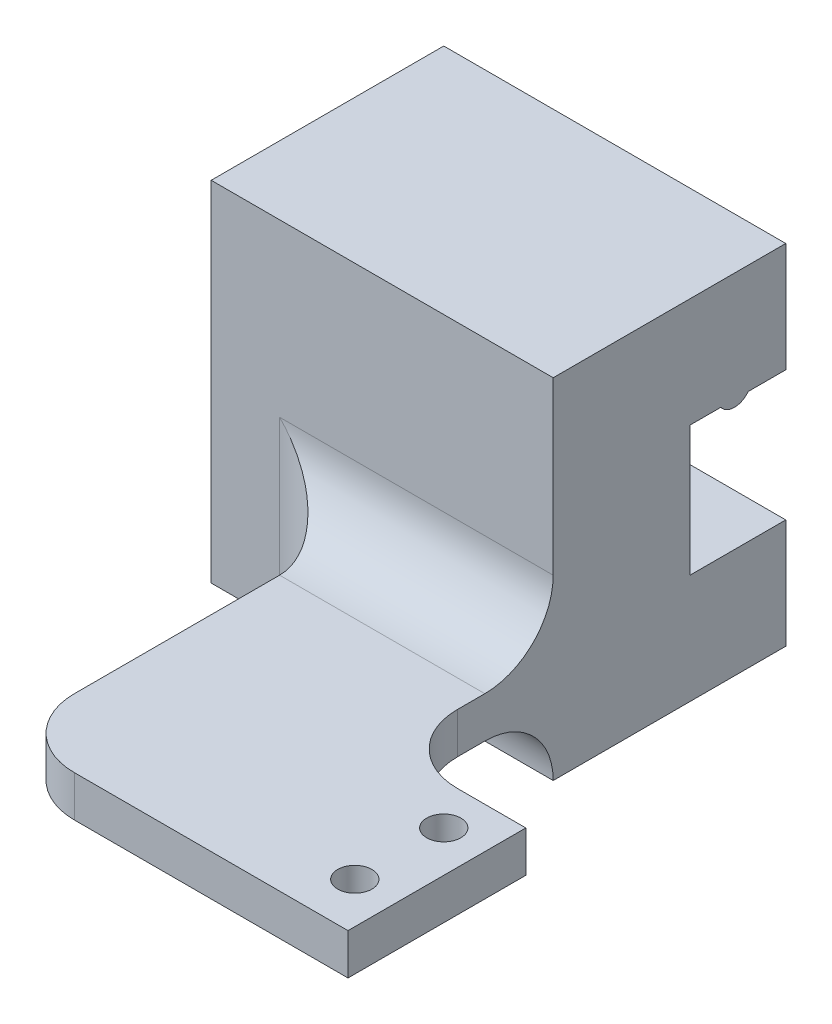
ISO-10303-21;
HEADER;
FILE_DESCRIPTION(('STEP AP214'),'2;1');
FILE_NAME('part.step','',(''),(''),'','','');
FILE_SCHEMA(('AUTOMOTIVE_DESIGN { 1 0 10303 214 1 1 1 1 }'));
ENDSEC;
DATA;
#1=APPLICATION_CONTEXT('core data for automotive mechanical design processes');
#2=APPLICATION_PROTOCOL_DEFINITION('international standard','automotive_design',2000,#1);
#3=PRODUCT_CONTEXT('',#1,'mechanical');
#4=PRODUCT('Part','Part','',(#3));
#5=PRODUCT_RELATED_PRODUCT_CATEGORY('part','',(#4));
#6=PRODUCT_DEFINITION_FORMATION('','',#4);
#7=PRODUCT_DEFINITION_CONTEXT('part definition',#1,'design');
#8=PRODUCT_DEFINITION('design','',#6,#7);
#9=PRODUCT_DEFINITION_SHAPE('','',#8);
#10=(LENGTH_UNIT() NAMED_UNIT(*) SI_UNIT(.MILLI.,.METRE.));
#11=(NAMED_UNIT(*) PLANE_ANGLE_UNIT() SI_UNIT($,.RADIAN.));
#12=(NAMED_UNIT(*) SI_UNIT($,.STERADIAN.) SOLID_ANGLE_UNIT());
#13=UNCERTAINTY_MEASURE_WITH_UNIT(LENGTH_MEASURE(1.E-05),#10,'distance_accuracy_value','');
#14=(GEOMETRIC_REPRESENTATION_CONTEXT(3) GLOBAL_UNCERTAINTY_ASSIGNED_CONTEXT((#13)) GLOBAL_UNIT_ASSIGNED_CONTEXT((#10,
#11,#12)) REPRESENTATION_CONTEXT('',''));
#15=CARTESIAN_POINT('',(0.,0.,0.));
#16=DIRECTION('',(0.,0.,1.));
#17=DIRECTION('',(1.,0.,0.));
#18=AXIS2_PLACEMENT_3D('',#15,#16,#17);
#19=CARTESIAN_POINT('',(0.,-20.5,0.));
#20=DIRECTION('',(0.,1.,0.));
#21=DIRECTION('',(0.,0.,1.));
#22=AXIS2_PLACEMENT_3D('',#19,#20,#21);
#23=PLANE('',#22);
#24=CARTESIAN_POINT('',(32.,-20.5,31.5));
#25=DIRECTION('',(0.,-1.,0.));
#26=DIRECTION('',(0.,0.,-1.));
#27=AXIS2_PLACEMENT_3D('',#24,#25,#26);
#28=CIRCLE('',#27,1.25);
#29=CARTESIAN_POINT('',(32.,-20.5,30.25));
#30=VERTEX_POINT('',#29);
#31=EDGE_CURVE('E333',#30,#30,#28,.T.);
#32=ORIENTED_EDGE('',*,*,#31,.F.);
#33=EDGE_LOOP('',(#32));
#34=FACE_BOUND('',#33,.T.);
#35=CARTESIAN_POINT('',(32.,-20.5,25.));
#36=DIRECTION('',(0.,-1.,0.));
#37=DIRECTION('',(0.,0.,-1.));
#38=AXIS2_PLACEMENT_3D('',#35,#36,#37);
#39=CIRCLE('',#38,1.25);
#40=CARTESIAN_POINT('',(32.,-20.5,23.75));
#41=VERTEX_POINT('',#40);
#42=EDGE_CURVE('E189',#41,#41,#39,.T.);
#43=ORIENTED_EDGE('',*,*,#42,.F.);
#44=EDGE_LOOP('',(#43));
#45=FACE_BOUND('',#44,.T.);
#46=DIRECTION('',(1.,0.,0.));
#47=VECTOR('',#46,1.);
#48=CARTESIAN_POINT('',(10.,-20.5,35.));
#49=LINE('',#48,#47);
#50=CARTESIAN_POINT('',(15.,-20.5,35.));
#51=VERTEX_POINT('',#50);
#52=CARTESIAN_POINT('',(35.,-20.5,35.));
#53=VERTEX_POINT('',#52);
#54=EDGE_CURVE('E218',#51,#53,#49,.T.);
#55=ORIENTED_EDGE('',*,*,#54,.F.);
#56=CARTESIAN_POINT('',(15.,-20.5,30.));
#57=DIRECTION('',(0.,1.,0.));
#58=DIRECTION('',(0.,0.,1.));
#59=AXIS2_PLACEMENT_3D('',#56,#57,#58);
#60=CIRCLE('',#59,5.);
#61=CARTESIAN_POINT('',(10.,-20.5,30.));
#62=VERTEX_POINT('',#61);
#63=EDGE_CURVE('E319',#51,#62,#60,.F.);
#64=ORIENTED_EDGE('',*,*,#63,.T.);
#65=DIRECTION('',(0.,0.,1.));
#66=VECTOR('',#65,1.);
#67=CARTESIAN_POINT('',(10.,-20.5,0.));
#68=LINE('',#67,#66);
#69=CARTESIAN_POINT('',(10.,-20.5,15.));
#70=VERTEX_POINT('',#69);
#71=EDGE_CURVE('E215',#70,#62,#68,.T.);
#72=ORIENTED_EDGE('',*,*,#71,.F.);
#73=DIRECTION('',(-1.,0.,0.));
#74=VECTOR('',#73,1.);
#75=CARTESIAN_POINT('',(0.,-20.5,15.));
#76=LINE('',#75,#74);
#77=CARTESIAN_POINT('',(25.,-20.5,15.));
#78=VERTEX_POINT('',#77);
#79=EDGE_CURVE('E317',#70,#78,#76,.F.);
#80=ORIENTED_EDGE('',*,*,#79,.T.);
#81=DIRECTION('',(0.,0.,1.));
#82=VECTOR('',#81,1.);
#83=CARTESIAN_POINT('',(25.,-20.5,0.));
#84=LINE('',#83,#82);
#85=CARTESIAN_POINT('',(25.,-20.5,17.));
#86=VERTEX_POINT('',#85);
#87=EDGE_CURVE('E188',#78,#86,#84,.T.);
#88=ORIENTED_EDGE('',*,*,#87,.T.);
#89=CARTESIAN_POINT('',(30.,-20.5,17.));
#90=DIRECTION('',(0.,1.,0.));
#91=DIRECTION('',(0.,0.,1.));
#92=AXIS2_PLACEMENT_3D('',#89,#90,#91);
#93=CIRCLE('',#92,5.);
#94=CARTESIAN_POINT('',(30.,-20.5,22.));
#95=VERTEX_POINT('',#94);
#96=EDGE_CURVE('E185',#86,#95,#93,.T.);
#97=ORIENTED_EDGE('',*,*,#96,.T.);
#98=DIRECTION('',(1.,0.,0.));
#99=VECTOR('',#98,1.);
#100=CARTESIAN_POINT('',(0.,-20.5,22.));
#101=LINE('',#100,#99);
#102=CARTESIAN_POINT('',(35.,-20.5,22.));
#103=VERTEX_POINT('',#102);
#104=EDGE_CURVE('E179',#95,#103,#101,.T.);
#105=ORIENTED_EDGE('',*,*,#104,.T.);
#106=DIRECTION('',(0.,0.,-1.));
#107=VECTOR('',#106,1.);
#108=CARTESIAN_POINT('',(35.,-20.5,0.));
#109=LINE('',#108,#107);
#110=EDGE_CURVE('E183',#53,#103,#109,.T.);
#111=ORIENTED_EDGE('',*,*,#110,.F.);
#112=EDGE_LOOP('',(#55,#64,#72,#80,#88,#97,#105,#111));
#113=FACE_BOUND('',#112,.T.);
#114=ADVANCED_FACE('F45',(#34,#45,#113),#23,.F.);
#115=CARTESIAN_POINT('',(0.,-17.5,0.));
#116=DIRECTION('',(0.,1.,0.));
#117=DIRECTION('',(0.,0.,1.));
#118=AXIS2_PLACEMENT_3D('',#115,#116,#117);
#119=PLANE('',#118);
#120=CARTESIAN_POINT('',(32.,-17.5,25.));
#121=DIRECTION('',(0.,1.,0.));
#122=DIRECTION('',(0.,0.,1.));
#123=AXIS2_PLACEMENT_3D('',#120,#121,#122);
#124=CIRCLE('',#123,1.25);
#125=CARTESIAN_POINT('',(32.,-17.5,26.25));
#126=VERTEX_POINT('',#125);
#127=EDGE_CURVE('E297',#126,#126,#124,.T.);
#128=ORIENTED_EDGE('',*,*,#127,.F.);
#129=EDGE_LOOP('',(#128));
#130=FACE_BOUND('',#129,.T.);
#131=CARTESIAN_POINT('',(32.,-17.5,31.5));
#132=DIRECTION('',(0.,1.,0.));
#133=DIRECTION('',(0.,0.,1.));
#134=AXIS2_PLACEMENT_3D('',#131,#132,#133);
#135=CIRCLE('',#134,1.25);
#136=CARTESIAN_POINT('',(32.,-17.5,32.75));
#137=VERTEX_POINT('',#136);
#138=EDGE_CURVE('E294',#137,#137,#135,.T.);
#139=ORIENTED_EDGE('',*,*,#138,.F.);
#140=EDGE_LOOP('',(#139));
#141=FACE_BOUND('',#140,.T.);
#142=DIRECTION('',(0.,0.,1.));
#143=VECTOR('',#142,1.);
#144=CARTESIAN_POINT('',(10.,-17.5,0.));
#145=LINE('',#144,#143);
#146=CARTESIAN_POINT('',(10.,-17.5,15.0000000000002));
#147=VERTEX_POINT('',#146);
#148=CARTESIAN_POINT('',(10.,-17.5,30.));
#149=VERTEX_POINT('',#148);
#150=EDGE_CURVE('E206',#147,#149,#145,.T.);
#151=ORIENTED_EDGE('',*,*,#150,.T.);
#152=CARTESIAN_POINT('',(15.,-17.5,30.));
#153=DIRECTION('',(0.,1.,0.));
#154=DIRECTION('',(0.,0.,1.));
#155=AXIS2_PLACEMENT_3D('',#152,#153,#154);
#156=CIRCLE('',#155,5.);
#157=CARTESIAN_POINT('',(15.,-17.5,35.));
#158=VERTEX_POINT('',#157);
#159=EDGE_CURVE('E313',#149,#158,#156,.T.);
#160=ORIENTED_EDGE('',*,*,#159,.T.);
#161=DIRECTION('',(1.,0.,0.));
#162=VECTOR('',#161,1.);
#163=CARTESIAN_POINT('',(10.,-17.5,35.));
#164=LINE('',#163,#162);
#165=CARTESIAN_POINT('',(35.,-17.5,35.));
#166=VERTEX_POINT('',#165);
#167=EDGE_CURVE('E209',#158,#166,#164,.T.);
#168=ORIENTED_EDGE('',*,*,#167,.T.);
#169=DIRECTION('',(0.,0.,1.));
#170=VECTOR('',#169,1.);
#171=CARTESIAN_POINT('',(35.,-17.5,0.));
#172=LINE('',#171,#170);
#173=CARTESIAN_POINT('',(35.,-17.5,22.));
#174=VERTEX_POINT('',#173);
#175=EDGE_CURVE('E211',#174,#166,#172,.T.);
#176=ORIENTED_EDGE('',*,*,#175,.F.);
#177=DIRECTION('',(-1.,0.,0.));
#178=VECTOR('',#177,1.);
#179=CARTESIAN_POINT('',(0.,-17.5,22.));
#180=LINE('',#179,#178);
#181=CARTESIAN_POINT('',(30.,-17.5,22.));
#182=VERTEX_POINT('',#181);
#183=EDGE_CURVE('E195',#174,#182,#180,.T.);
#184=ORIENTED_EDGE('',*,*,#183,.T.);
#185=CARTESIAN_POINT('',(30.,-17.5,17.));
#186=DIRECTION('',(0.,1.,0.));
#187=DIRECTION('',(0.,0.,1.));
#188=AXIS2_PLACEMENT_3D('',#185,#186,#187);
#189=CIRCLE('',#188,5.);
#190=CARTESIAN_POINT('',(25.,-17.5,17.));
#191=VERTEX_POINT('',#190);
#192=EDGE_CURVE('E325',#182,#191,#189,.F.);
#193=ORIENTED_EDGE('',*,*,#192,.T.);
#194=DIRECTION('',(0.,0.,-1.));
#195=VECTOR('',#194,1.);
#196=CARTESIAN_POINT('',(25.,-17.5,0.));
#197=LINE('',#196,#195);
#198=CARTESIAN_POINT('',(25.,-17.5,15.0000000000002));
#199=VERTEX_POINT('',#198);
#200=EDGE_CURVE('E298',#191,#199,#197,.T.);
#201=ORIENTED_EDGE('',*,*,#200,.T.);
#202=DIRECTION('',(-1.,0.,0.));
#203=VECTOR('',#202,1.);
#204=CARTESIAN_POINT('',(10.,-17.5,15.0000000000002));
#205=LINE('',#204,#203);
#206=EDGE_CURVE('E311',#199,#147,#205,.T.);
#207=ORIENTED_EDGE('',*,*,#206,.T.);
#208=EDGE_LOOP('',(#151,#160,#168,#176,#184,#193,#201,#207));
#209=FACE_BOUND('',#208,.T.);
#210=ADVANCED_FACE('F358',(#130,#141,#209),#119,.T.);
#211=CARTESIAN_POINT('',(35.,0.,0.));
#212=DIRECTION('',(1.,0.,0.));
#213=DIRECTION('',(0.,0.,-1.));
#214=AXIS2_PLACEMENT_3D('',#211,#212,#213);
#215=PLANE('',#214);
#216=ORIENTED_EDGE('',*,*,#110,.T.);
#217=DIRECTION('',(0.,1.,0.));
#218=VECTOR('',#217,1.);
#219=CARTESIAN_POINT('',(35.,0.,22.));
#220=LINE('',#219,#218);
#221=EDGE_CURVE('E192',#103,#174,#220,.T.);
#222=ORIENTED_EDGE('',*,*,#221,.T.);
#223=ORIENTED_EDGE('',*,*,#175,.T.);
#224=DIRECTION('',(0.,-1.,0.));
#225=VECTOR('',#224,1.);
#226=CARTESIAN_POINT('',(35.,0.,35.));
#227=LINE('',#226,#225);
#228=EDGE_CURVE('E205',#166,#53,#227,.T.);
#229=ORIENTED_EDGE('',*,*,#228,.T.);
#230=EDGE_LOOP('',(#216,#222,#223,#229));
#231=FACE_BOUND('',#230,.T.);
#232=ADVANCED_FACE('F203',(#231),#215,.T.);
#233=CARTESIAN_POINT('',(50.,-1.44900431522774E-13,10.0000000000004));
#234=DIRECTION('',(0.,0.,1.));
#235=DIRECTION('',(0.,-1.,0.));
#236=AXIS2_PLACEMENT_3D('',#233,#234,#235);
#237=PLANE('',#236);
#238=DIRECTION('',(-1.,0.,0.));
#239=VECTOR('',#238,1.);
#240=CARTESIAN_POINT('',(27.,-25.5,10.0000000000004));
#241=LINE('',#240,#239);
#242=CARTESIAN_POINT('',(5.,-25.5,10.0000000000004));
#243=VERTEX_POINT('',#242);
#244=CARTESIAN_POINT('',(0.,-25.5,10.0000000000004));
#245=VERTEX_POINT('',#244);
#246=EDGE_CURVE('E67',#243,#245,#241,.T.);
#247=ORIENTED_EDGE('',*,*,#246,.F.);
#248=DIRECTION('',(0.,-1.,0.));
#249=VECTOR('',#248,1.);
#250=CARTESIAN_POINT('',(5.,-17.5,10.0000000000001));
#251=LINE('',#250,#249);
#252=CARTESIAN_POINT('',(5.,-12.4999999999999,10.0000000000002));
#253=VERTEX_POINT('',#252);
#254=EDGE_CURVE('E62',#243,#253,#251,.F.);
#255=ORIENTED_EDGE('',*,*,#254,.T.);
#256=DIRECTION('',(-1.,0.,0.));
#257=VECTOR('',#256,1.);
#258=CARTESIAN_POINT('',(25.,-12.4999999999999,10.0000000000002));
#259=LINE('',#258,#257);
#260=CARTESIAN_POINT('',(25.,-12.4999999999999,10.0000000000004));
#261=VERTEX_POINT('',#260);
#262=EDGE_CURVE('E321',#253,#261,#259,.F.);
#263=ORIENTED_EDGE('',*,*,#262,.T.);
#264=DIRECTION('',(0.,-1.,0.));
#265=VECTOR('',#264,1.);
#266=CARTESIAN_POINT('',(25.,0.,10.0000000000004));
#267=LINE('',#266,#265);
#268=CARTESIAN_POINT('',(25.,0.,10.0000000000004));
#269=VERTEX_POINT('',#268);
#270=EDGE_CURVE('E234',#269,#261,#267,.T.);
#271=ORIENTED_EDGE('',*,*,#270,.F.);
#272=DIRECTION('',(-1.,0.,0.));
#273=VECTOR('',#272,1.);
#274=CARTESIAN_POINT('',(50.,0.,10.0000000000004));
#275=LINE('',#274,#273);
#276=CARTESIAN_POINT('',(0.,0.,10.0000000000004));
#277=VERTEX_POINT('',#276);
#278=EDGE_CURVE('E282',#269,#277,#275,.T.);
#279=ORIENTED_EDGE('',*,*,#278,.T.);
#280=DIRECTION('',(0.,1.,0.));
#281=VECTOR('',#280,1.);
#282=CARTESIAN_POINT('',(0.,0.,10.0000000000004));
#283=LINE('',#282,#281);
#284=EDGE_CURVE('E267',#245,#277,#283,.T.);
#285=ORIENTED_EDGE('',*,*,#284,.F.);
#286=EDGE_LOOP('',(#247,#255,#263,#271,#279,#285));
#287=FACE_BOUND('',#286,.T.);
#288=ADVANCED_FACE('F415',(#287),#237,.T.);
#289=CARTESIAN_POINT('',(27.,-25.5,-95.3122797569397));
#290=DIRECTION('',(0.,1.,0.));
#291=DIRECTION('',(0.,0.,1.));
#292=AXIS2_PLACEMENT_3D('',#289,#290,#291);
#293=PLANE('',#292);
#294=CARTESIAN_POINT('',(25.,-25.5,10.0000000000004));
#295=VERTEX_POINT('',#294);
#296=EDGE_CURVE('E269',#295,#243,#241,.T.);
#297=ORIENTED_EDGE('',*,*,#296,.T.);
#298=ORIENTED_EDGE('',*,*,#246,.T.);
#299=DIRECTION('',(0.,0.,-1.));
#300=VECTOR('',#299,1.);
#301=CARTESIAN_POINT('',(0.,-25.5,10.0000000000004));
#302=LINE('',#301,#300);
#303=CARTESIAN_POINT('',(0.,-25.5,-7.));
#304=VERTEX_POINT('',#303);
#305=EDGE_CURVE('E219',#245,#304,#302,.T.);
#306=ORIENTED_EDGE('',*,*,#305,.T.);
#307=DIRECTION('',(1.,0.,0.));
#308=VECTOR('',#307,1.);
#309=CARTESIAN_POINT('',(27.,-25.5,-7.00000000000001));
#310=LINE('',#309,#308);
#311=CARTESIAN_POINT('',(25.,-25.5,-7.));
#312=VERTEX_POINT('',#311);
#313=EDGE_CURVE('E226',#304,#312,#310,.T.);
#314=ORIENTED_EDGE('',*,*,#313,.T.);
#315=DIRECTION('',(0.,0.,-1.));
#316=VECTOR('',#315,1.);
#317=CARTESIAN_POINT('',(25.,-25.5,-95.3122797569397));
#318=LINE('',#317,#316);
#319=EDGE_CURVE('E237',#295,#312,#318,.T.);
#320=ORIENTED_EDGE('',*,*,#319,.F.);
#321=EDGE_LOOP('',(#297,#298,#306,#314,#320));
#322=FACE_BOUND('',#321,.T.);
#323=ADVANCED_FACE('F374',(#322),#293,.F.);
#324=CARTESIAN_POINT('',(0.,-8.,50.));
#325=DIRECTION('',(0.,1.,0.));
#326=DIRECTION('',(-1.,0.,0.));
#327=AXIS2_PLACEMENT_3D('',#324,#325,#326);
#328=PLANE('',#327);
#329=DIRECTION('',(0.,0.,-1.));
#330=VECTOR('',#329,1.);
#331=CARTESIAN_POINT('',(25.,-8.,50.));
#332=LINE('',#331,#330);
#333=CARTESIAN_POINT('',(25.,-8.,0.));
#334=VERTEX_POINT('',#333);
#335=CARTESIAN_POINT('',(25.,-8.,-2.25000000000024));
#336=VERTEX_POINT('',#335);
#337=EDGE_CURVE('E244',#334,#336,#332,.T.);
#338=ORIENTED_EDGE('',*,*,#337,.F.);
#339=DIRECTION('',(1.,0.,0.));
#340=VECTOR('',#339,1.);
#341=CARTESIAN_POINT('',(0.,-8.,0.));
#342=LINE('',#341,#340);
#343=CARTESIAN_POINT('',(0.,-8.,0.));
#344=VERTEX_POINT('',#343);
#345=EDGE_CURVE('E288',#344,#334,#342,.T.);
#346=ORIENTED_EDGE('',*,*,#345,.F.);
#347=DIRECTION('',(0.,0.,-1.));
#348=VECTOR('',#347,1.);
#349=CARTESIAN_POINT('',(0.,-8.,50.));
#350=LINE('',#349,#348);
#351=CARTESIAN_POINT('',(0.,-8.,-2.25000000000024));
#352=VERTEX_POINT('',#351);
#353=EDGE_CURVE('E260',#344,#352,#350,.T.);
#354=ORIENTED_EDGE('',*,*,#353,.T.);
#355=DIRECTION('',(-1.,0.,0.));
#356=VECTOR('',#355,1.);
#357=CARTESIAN_POINT('',(50.,-8.,-2.25000000000025));
#358=LINE('',#357,#356);
#359=EDGE_CURVE('E280',#336,#352,#358,.T.);
#360=ORIENTED_EDGE('',*,*,#359,.F.);
#361=EDGE_LOOP('',(#338,#346,#354,#360));
#362=FACE_BOUND('',#361,.T.);
#363=ADVANCED_FACE('F391',(#362),#328,.F.);
#364=CARTESIAN_POINT('',(0.,-17.5,50.));
#365=DIRECTION('',(0.,-1.,0.));
#366=DIRECTION('',(1.,0.,0.));
#367=AXIS2_PLACEMENT_3D('',#364,#365,#366);
#368=PLANE('',#367);
#369=DIRECTION('',(0.,0.,1.));
#370=VECTOR('',#369,1.);
#371=CARTESIAN_POINT('',(25.,-17.5,50.));
#372=LINE('',#371,#370);
#373=CARTESIAN_POINT('',(25.,-17.5,-7.00000000000001));
#374=VERTEX_POINT('',#373);
#375=CARTESIAN_POINT('',(25.,-17.5,0.));
#376=VERTEX_POINT('',#375);
#377=EDGE_CURVE('E240',#374,#376,#372,.T.);
#378=ORIENTED_EDGE('',*,*,#377,.F.);
#379=DIRECTION('',(-1.,0.,0.));
#380=VECTOR('',#379,1.);
#381=CARTESIAN_POINT('',(0.,-17.5,-7.));
#382=LINE('',#381,#380);
#383=CARTESIAN_POINT('',(0.,-17.5,-7.));
#384=VERTEX_POINT('',#383);
#385=EDGE_CURVE('E229',#374,#384,#382,.T.);
#386=ORIENTED_EDGE('',*,*,#385,.T.);
#387=DIRECTION('',(0.,0.,1.));
#388=VECTOR('',#387,1.);
#389=CARTESIAN_POINT('',(0.,-17.5,50.));
#390=LINE('',#389,#388);
#391=CARTESIAN_POINT('',(0.,-17.5,0.));
#392=VERTEX_POINT('',#391);
#393=EDGE_CURVE('E257',#384,#392,#390,.T.);
#394=ORIENTED_EDGE('',*,*,#393,.T.);
#395=DIRECTION('',(-1.,0.,0.));
#396=VECTOR('',#395,1.);
#397=CARTESIAN_POINT('',(0.,-17.5,0.));
#398=LINE('',#397,#396);
#399=EDGE_CURVE('E291',#376,#392,#398,.T.);
#400=ORIENTED_EDGE('',*,*,#399,.F.);
#401=EDGE_LOOP('',(#378,#386,#394,#400));
#402=FACE_BOUND('',#401,.T.);
#403=ADVANCED_FACE('F382',(#402),#368,.F.);
#404=CARTESIAN_POINT('',(0.,0.,50.));
#405=DIRECTION('',(0.,-1.,0.));
#406=DIRECTION('',(1.,0.,0.));
#407=AXIS2_PLACEMENT_3D('',#404,#405,#406);
#408=PLANE('',#407);
#409=DIRECTION('',(0.,0.,1.));
#410=VECTOR('',#409,1.);
#411=CARTESIAN_POINT('',(25.,0.,-32.5));
#412=LINE('',#411,#410);
#413=CARTESIAN_POINT('',(25.,0.,-7.));
#414=VERTEX_POINT('',#413);
#415=EDGE_CURVE('E232',#414,#269,#412,.T.);
#416=ORIENTED_EDGE('',*,*,#415,.F.);
#417=DIRECTION('',(-1.,0.,0.));
#418=VECTOR('',#417,1.);
#419=CARTESIAN_POINT('',(50.,0.,-7.));
#420=LINE('',#419,#418);
#421=CARTESIAN_POINT('',(0.,0.,-7.));
#422=VERTEX_POINT('',#421);
#423=EDGE_CURVE('E274',#414,#422,#420,.T.);
#424=ORIENTED_EDGE('',*,*,#423,.T.);
#425=DIRECTION('',(0.,0.,1.));
#426=VECTOR('',#425,1.);
#427=CARTESIAN_POINT('',(0.,0.,-32.5));
#428=LINE('',#427,#426);
#429=EDGE_CURVE('E254',#422,#277,#428,.T.);
#430=ORIENTED_EDGE('',*,*,#429,.T.);
#431=ORIENTED_EDGE('',*,*,#278,.F.);
#432=EDGE_LOOP('',(#416,#424,#430,#431));
#433=FACE_BOUND('',#432,.T.);
#434=ADVANCED_FACE('F413',(#433),#408,.F.);
#435=DIRECTION('',(0.,0.,-1.));
#436=VECTOR('',#435,1.);
#437=CARTESIAN_POINT('',(25.,-8.,50.));
#438=LINE('',#437,#436);
#439=CARTESIAN_POINT('',(25.,-8.,-4.24999999999976));
#440=VERTEX_POINT('',#439);
#441=CARTESIAN_POINT('',(25.,-8.,-7.));
#442=VERTEX_POINT('',#441);
#443=EDGE_CURVE('E249',#440,#442,#438,.T.);
#444=ORIENTED_EDGE('',*,*,#443,.F.);
#445=DIRECTION('',(-1.,0.,0.));
#446=VECTOR('',#445,1.);
#447=CARTESIAN_POINT('',(50.,-8.,-4.24999999999976));
#448=LINE('',#447,#446);
#449=CARTESIAN_POINT('',(0.,-8.,-4.24999999999976));
#450=VERTEX_POINT('',#449);
#451=EDGE_CURVE('E278',#440,#450,#448,.T.);
#452=ORIENTED_EDGE('',*,*,#451,.T.);
#453=CARTESIAN_POINT('',(0.,-8.,-7.));
#454=VERTEX_POINT('',#453);
#455=EDGE_CURVE('E263',#450,#454,#350,.T.);
#456=ORIENTED_EDGE('',*,*,#455,.T.);
#457=DIRECTION('',(-1.,0.,0.));
#458=VECTOR('',#457,1.);
#459=CARTESIAN_POINT('',(50.,-8.,-7.));
#460=LINE('',#459,#458);
#461=EDGE_CURVE('E276',#442,#454,#460,.T.);
#462=ORIENTED_EDGE('',*,*,#461,.F.);
#463=EDGE_LOOP('',(#444,#452,#456,#462));
#464=FACE_BOUND('',#463,.T.);
#465=ADVANCED_FACE('F399',(#464),#328,.F.);
#466=CARTESIAN_POINT('',(0.,0.,0.));
#467=DIRECTION('',(0.,0.,1.));
#468=DIRECTION('',(1.,0.,0.));
#469=AXIS2_PLACEMENT_3D('',#466,#467,#468);
#470=PLANE('',#469);
#471=DIRECTION('',(0.,1.,0.));
#472=VECTOR('',#471,1.);
#473=CARTESIAN_POINT('',(25.,0.,0.));
#474=LINE('',#473,#472);
#475=EDGE_CURVE('E242',#376,#334,#474,.T.);
#476=ORIENTED_EDGE('',*,*,#475,.F.);
#477=ORIENTED_EDGE('',*,*,#399,.T.);
#478=DIRECTION('',(0.,-1.,0.));
#479=VECTOR('',#478,1.);
#480=CARTESIAN_POINT('',(0.,0.,0.));
#481=LINE('',#480,#479);
#482=EDGE_CURVE('E285',#344,#392,#481,.T.);
#483=ORIENTED_EDGE('',*,*,#482,.F.);
#484=ORIENTED_EDGE('',*,*,#345,.T.);
#485=EDGE_LOOP('',(#476,#477,#483,#484));
#486=FACE_BOUND('',#485,.T.);
#487=ADVANCED_FACE('F386',(#486),#470,.F.);
#488=CARTESIAN_POINT('',(50.,-7.24999999999968,-3.25));
#489=DIRECTION('',(-1.,0.,0.));
#490=DIRECTION('',(0.,0.,1.));
#491=AXIS2_PLACEMENT_3D('',#488,#489,#490);
#492=CYLINDRICAL_SURFACE('',#491,1.25);
#493=ORIENTED_EDGE('',*,*,#451,.F.);
#494=CARTESIAN_POINT('',(25.,-7.24999999999968,-3.25));
#495=DIRECTION('',(1.,0.,0.));
#496=DIRECTION('',(0.,0.,-1.));
#497=AXIS2_PLACEMENT_3D('',#494,#495,#496);
#498=CIRCLE('',#497,1.25);
#499=EDGE_CURVE('E246',#440,#336,#498,.F.);
#500=ORIENTED_EDGE('',*,*,#499,.T.);
#501=ORIENTED_EDGE('',*,*,#359,.T.);
#502=CARTESIAN_POINT('',(0.,-7.24999999999968,-3.25));
#503=DIRECTION('',(1.,0.,0.));
#504=DIRECTION('',(0.,0.,-1.));
#505=AXIS2_PLACEMENT_3D('',#502,#503,#504);
#506=CIRCLE('',#505,1.25);
#507=EDGE_CURVE('E271',#450,#352,#506,.F.);
#508=ORIENTED_EDGE('',*,*,#507,.F.);
#509=EDGE_LOOP('',(#493,#500,#501,#508));
#510=FACE_BOUND('',#509,.T.);
#511=ADVANCED_FACE('F395',(#510),#492,.T.);
#512=CARTESIAN_POINT('',(50.,0.,-7.));
#513=DIRECTION('',(0.,0.,-1.));
#514=DIRECTION('',(0.,1.,0.));
#515=AXIS2_PLACEMENT_3D('',#512,#513,#514);
#516=PLANE('',#515);
#517=ORIENTED_EDGE('',*,*,#423,.F.);
#518=DIRECTION('',(0.,-1.,0.));
#519=VECTOR('',#518,1.);
#520=CARTESIAN_POINT('',(25.,0.,-7.));
#521=LINE('',#520,#519);
#522=EDGE_CURVE('E251',#414,#442,#521,.T.);
#523=ORIENTED_EDGE('',*,*,#522,.T.);
#524=ORIENTED_EDGE('',*,*,#461,.T.);
#525=DIRECTION('',(0.,-1.,0.));
#526=VECTOR('',#525,1.);
#527=CARTESIAN_POINT('',(0.,0.,-7.));
#528=LINE('',#527,#526);
#529=EDGE_CURVE('E264',#422,#454,#528,.T.);
#530=ORIENTED_EDGE('',*,*,#529,.F.);
#531=EDGE_LOOP('',(#517,#523,#524,#530));
#532=FACE_BOUND('',#531,.T.);
#533=ADVANCED_FACE('F405',(#532),#516,.T.);
#534=CARTESIAN_POINT('',(0.,0.,50.));
#535=DIRECTION('',(1.,0.,0.));
#536=DIRECTION('',(0.,1.,0.));
#537=AXIS2_PLACEMENT_3D('',#534,#535,#536);
#538=PLANE('',#537);
#539=DIRECTION('',(0.,1.,0.));
#540=VECTOR('',#539,1.);
#541=CARTESIAN_POINT('',(0.,0.,-7.));
#542=LINE('',#541,#540);
#543=EDGE_CURVE('E224',#304,#384,#542,.T.);
#544=ORIENTED_EDGE('',*,*,#543,.F.);
#545=ORIENTED_EDGE('',*,*,#305,.F.);
#546=ORIENTED_EDGE('',*,*,#284,.T.);
#547=ORIENTED_EDGE('',*,*,#429,.F.);
#548=ORIENTED_EDGE('',*,*,#529,.T.);
#549=ORIENTED_EDGE('',*,*,#455,.F.);
#550=ORIENTED_EDGE('',*,*,#507,.T.);
#551=ORIENTED_EDGE('',*,*,#353,.F.);
#552=ORIENTED_EDGE('',*,*,#482,.T.);
#553=ORIENTED_EDGE('',*,*,#393,.F.);
#554=EDGE_LOOP('',(#544,#545,#546,#547,#548,#549,#550,#551,#552,#553));
#555=FACE_BOUND('',#554,.T.);
#556=ADVANCED_FACE('F409',(#555),#538,.F.);
#557=CARTESIAN_POINT('',(25.,0.,0.));
#558=DIRECTION('',(1.,0.,0.));
#559=DIRECTION('',(0.,0.,-1.));
#560=AXIS2_PLACEMENT_3D('',#557,#558,#559);
#561=PLANE('',#560);
#562=ORIENTED_EDGE('',*,*,#200,.F.);
#563=DIRECTION('',(0.,-1.,0.));
#564=VECTOR('',#563,1.);
#565=CARTESIAN_POINT('',(25.,-20.5,17.));
#566=LINE('',#565,#564);
#567=EDGE_CURVE('E199',#191,#86,#566,.T.);
#568=ORIENTED_EDGE('',*,*,#567,.T.);
#569=ORIENTED_EDGE('',*,*,#87,.F.);
#570=CARTESIAN_POINT('',(25.,-25.5,15.));
#571=DIRECTION('',(1.,0.,0.));
#572=DIRECTION('',(0.,0.,-1.));
#573=AXIS2_PLACEMENT_3D('',#570,#571,#572);
#574=CIRCLE('',#573,5.);
#575=EDGE_CURVE('E54',#78,#295,#574,.F.);
#576=ORIENTED_EDGE('',*,*,#575,.T.);
#577=ORIENTED_EDGE('',*,*,#319,.T.);
#578=DIRECTION('',(0.,-1.,0.));
#579=VECTOR('',#578,1.);
#580=CARTESIAN_POINT('',(25.,0.,-7.));
#581=LINE('',#580,#579);
#582=EDGE_CURVE('E200',#374,#312,#581,.T.);
#583=ORIENTED_EDGE('',*,*,#582,.F.);
#584=ORIENTED_EDGE('',*,*,#377,.T.);
#585=ORIENTED_EDGE('',*,*,#475,.T.);
#586=ORIENTED_EDGE('',*,*,#337,.T.);
#587=ORIENTED_EDGE('',*,*,#499,.F.);
#588=ORIENTED_EDGE('',*,*,#443,.T.);
#589=ORIENTED_EDGE('',*,*,#522,.F.);
#590=ORIENTED_EDGE('',*,*,#415,.T.);
#591=ORIENTED_EDGE('',*,*,#270,.T.);
#592=CARTESIAN_POINT('',(25.,-12.5,15.0000000000002));
#593=DIRECTION('',(1.,0.,0.));
#594=DIRECTION('',(0.,0.,-1.));
#595=AXIS2_PLACEMENT_3D('',#592,#593,#594);
#596=CIRCLE('',#595,5.);
#597=EDGE_CURVE('E11',#261,#199,#596,.F.);
#598=ORIENTED_EDGE('',*,*,#597,.T.);
#599=EDGE_LOOP('',(#562,#568,#569,#576,#577,#583,#584,#585,#586,#587,#588,#589,#590,#591,#598));
#600=FACE_BOUND('',#599,.T.);
#601=ADVANCED_FACE('F368',(#600),#561,.T.);
#602=CARTESIAN_POINT('',(0.,0.,-7.));
#603=DIRECTION('',(0.,0.,1.));
#604=DIRECTION('',(0.,-1.,0.));
#605=AXIS2_PLACEMENT_3D('',#602,#603,#604);
#606=PLANE('',#605);
#607=ORIENTED_EDGE('',*,*,#313,.F.);
#608=ORIENTED_EDGE('',*,*,#543,.T.);
#609=ORIENTED_EDGE('',*,*,#385,.F.);
#610=ORIENTED_EDGE('',*,*,#582,.T.);
#611=EDGE_LOOP('',(#607,#608,#609,#610));
#612=FACE_BOUND('',#611,.T.);
#613=ADVANCED_FACE('F441',(#612),#606,.F.);
#614=CARTESIAN_POINT('',(10.,-20.5,35.));
#615=DIRECTION('',(0.,0.,1.));
#616=DIRECTION('',(1.,0.,0.));
#617=AXIS2_PLACEMENT_3D('',#614,#615,#616);
#618=PLANE('',#617);
#619=ORIENTED_EDGE('',*,*,#167,.F.);
#620=DIRECTION('',(0.,1.,0.));
#621=VECTOR('',#620,1.);
#622=CARTESIAN_POINT('',(15.,-20.5,35.));
#623=LINE('',#622,#621);
#624=EDGE_CURVE('E315',#158,#51,#623,.F.);
#625=ORIENTED_EDGE('',*,*,#624,.T.);
#626=ORIENTED_EDGE('',*,*,#54,.T.);
#627=ORIENTED_EDGE('',*,*,#228,.F.);
#628=EDGE_LOOP('',(#619,#625,#626,#627));
#629=FACE_BOUND('',#628,.T.);
#630=ADVANCED_FACE('F348',(#629),#618,.T.);
#631=CARTESIAN_POINT('',(10.,-20.5,0.));
#632=DIRECTION('',(-1.,0.,0.));
#633=DIRECTION('',(0.,-1.,0.));
#634=AXIS2_PLACEMENT_3D('',#631,#632,#633);
#635=PLANE('',#634);
#636=ORIENTED_EDGE('',*,*,#71,.T.);
#637=DIRECTION('',(0.,1.,0.));
#638=VECTOR('',#637,1.);
#639=CARTESIAN_POINT('',(10.,-20.5,30.));
#640=LINE('',#639,#638);
#641=EDGE_CURVE('E308',#62,#149,#640,.T.);
#642=ORIENTED_EDGE('',*,*,#641,.T.);
#643=ORIENTED_EDGE('',*,*,#150,.F.);
#644=DIRECTION('',(0.,-1.,0.));
#645=VECTOR('',#644,1.);
#646=CARTESIAN_POINT('',(10.,-20.5000000000001,15.0000000000001));
#647=LINE('',#646,#645);
#648=EDGE_CURVE('E305',#147,#70,#647,.T.);
#649=ORIENTED_EDGE('',*,*,#648,.T.);
#650=EDGE_LOOP('',(#636,#642,#643,#649));
#651=FACE_BOUND('',#650,.T.);
#652=ADVANCED_FACE('F357',(#651),#635,.T.);
#653=CARTESIAN_POINT('',(0.,0.,22.));
#654=DIRECTION('',(0.,0.,-1.));
#655=DIRECTION('',(-1.,0.,0.));
#656=AXIS2_PLACEMENT_3D('',#653,#654,#655);
#657=PLANE('',#656);
#658=ORIENTED_EDGE('',*,*,#104,.F.);
#659=DIRECTION('',(0.,-1.,0.));
#660=VECTOR('',#659,1.);
#661=CARTESIAN_POINT('',(30.,-17.5,22.));
#662=LINE('',#661,#660);
#663=EDGE_CURVE('E303',#95,#182,#662,.F.);
#664=ORIENTED_EDGE('',*,*,#663,.T.);
#665=ORIENTED_EDGE('',*,*,#183,.F.);
#666=ORIENTED_EDGE('',*,*,#221,.F.);
#667=EDGE_LOOP('',(#658,#664,#665,#666));
#668=FACE_BOUND('',#667,.T.);
#669=ADVANCED_FACE('F193',(#668),#657,.T.);
#670=CARTESIAN_POINT('',(32.,0.,31.5));
#671=DIRECTION('',(0.,-1.,0.));
#672=DIRECTION('',(0.,0.,-1.));
#673=AXIS2_PLACEMENT_3D('',#670,#671,#672);
#674=CYLINDRICAL_SURFACE('',#673,1.25);
#675=ORIENTED_EDGE('',*,*,#138,.T.);
#676=EDGE_LOOP('',(#675));
#677=FACE_BOUND('',#676,.T.);
#678=ORIENTED_EDGE('',*,*,#31,.T.);
#679=EDGE_LOOP('',(#678));
#680=FACE_BOUND('',#679,.T.);
#681=ADVANCED_FACE('F495',(#677,#680),#674,.F.);
#682=CARTESIAN_POINT('',(32.,0.,25.));
#683=DIRECTION('',(0.,-1.,0.));
#684=DIRECTION('',(0.,0.,-1.));
#685=AXIS2_PLACEMENT_3D('',#682,#683,#684);
#686=CYLINDRICAL_SURFACE('',#685,1.25);
#687=ORIENTED_EDGE('',*,*,#127,.T.);
#688=EDGE_LOOP('',(#687));
#689=FACE_BOUND('',#688,.T.);
#690=ORIENTED_EDGE('',*,*,#42,.T.);
#691=EDGE_LOOP('',(#690));
#692=FACE_BOUND('',#691,.T.);
#693=ADVANCED_FACE('F469',(#689,#692),#686,.F.);
#694=CARTESIAN_POINT('',(30.,0.,17.));
#695=DIRECTION('',(0.,1.,0.));
#696=DIRECTION('',(0.,0.,1.));
#697=AXIS2_PLACEMENT_3D('',#694,#695,#696);
#698=CYLINDRICAL_SURFACE('',#697,5.);
#699=ORIENTED_EDGE('',*,*,#192,.F.);
#700=ORIENTED_EDGE('',*,*,#663,.F.);
#701=ORIENTED_EDGE('',*,*,#96,.F.);
#702=ORIENTED_EDGE('',*,*,#567,.F.);
#703=EDGE_LOOP('',(#699,#700,#701,#702));
#704=FACE_BOUND('',#703,.T.);
#705=ADVANCED_FACE('F466',(#704),#698,.F.);
#706=CARTESIAN_POINT('',(15.,-20.5,30.));
#707=DIRECTION('',(0.,1.,0.));
#708=DIRECTION('',(-1.,0.,0.));
#709=AXIS2_PLACEMENT_3D('',#706,#707,#708);
#710=CYLINDRICAL_SURFACE('',#709,5.);
#711=ORIENTED_EDGE('',*,*,#63,.F.);
#712=ORIENTED_EDGE('',*,*,#624,.F.);
#713=ORIENTED_EDGE('',*,*,#159,.F.);
#714=ORIENTED_EDGE('',*,*,#641,.F.);
#715=EDGE_LOOP('',(#711,#712,#713,#714));
#716=FACE_BOUND('',#715,.T.);
#717=ADVANCED_FACE('F354',(#716),#710,.T.);
#718=CARTESIAN_POINT('',(0.,-12.5,15.0000000000002));
#719=DIRECTION('',(1.,0.,0.));
#720=DIRECTION('',(0.,0.,-1.));
#721=AXIS2_PLACEMENT_3D('',#718,#719,#720);
#722=CYLINDRICAL_SURFACE('',#721,5.);
#723=ORIENTED_EDGE('',*,*,#597,.F.);
#724=ORIENTED_EDGE('',*,*,#262,.F.);
#725=CARTESIAN_POINT('',(5.,-12.5,15.0000000000002));
#726=DIRECTION('',(0.707106781186547,0.707106781186548,0.));
#727=DIRECTION('',(0.707106781186548,-0.707106781186547,0.));
#728=AXIS2_PLACEMENT_3D('',#725,#726,#727);
#729=ELLIPSE('',#728,7.07106781186548,5.);
#730=EDGE_CURVE('E49',#147,#253,#729,.T.);
#731=ORIENTED_EDGE('',*,*,#730,.F.);
#732=ORIENTED_EDGE('',*,*,#206,.F.);
#733=EDGE_LOOP('',(#723,#724,#731,#732));
#734=FACE_BOUND('',#733,.T.);
#735=ADVANCED_FACE('F47',(#734),#722,.F.);
#736=CARTESIAN_POINT('',(50.,-25.5,15.));
#737=DIRECTION('',(-1.,0.,0.));
#738=DIRECTION('',(0.,0.,1.));
#739=AXIS2_PLACEMENT_3D('',#736,#737,#738);
#740=CYLINDRICAL_SURFACE('',#739,5.);
#741=ORIENTED_EDGE('',*,*,#575,.F.);
#742=ORIENTED_EDGE('',*,*,#79,.F.);
#743=CARTESIAN_POINT('',(5.,-25.5,15.));
#744=DIRECTION('',(-0.707106781186548,0.707106781186547,0.));
#745=DIRECTION('',(-0.707106781186547,-0.707106781186548,0.));
#746=AXIS2_PLACEMENT_3D('',#743,#744,#745);
#747=ELLIPSE('',#746,7.07106781186547,5.);
#748=EDGE_CURVE('E327',#243,#70,#747,.F.);
#749=ORIENTED_EDGE('',*,*,#748,.F.);
#750=ORIENTED_EDGE('',*,*,#296,.F.);
#751=EDGE_LOOP('',(#741,#742,#749,#750));
#752=FACE_BOUND('',#751,.T.);
#753=ADVANCED_FACE('F372',(#752),#740,.F.);
#754=CARTESIAN_POINT('',(5.,-20.5000000000002,15.0000000000001));
#755=DIRECTION('',(0.,1.,0.));
#756=DIRECTION('',(0.,0.,1.));
#757=AXIS2_PLACEMENT_3D('',#754,#755,#756);
#758=CYLINDRICAL_SURFACE('',#757,5.);
#759=ORIENTED_EDGE('',*,*,#730,.T.);
#760=ORIENTED_EDGE('',*,*,#254,.F.);
#761=ORIENTED_EDGE('',*,*,#748,.T.);
#762=ORIENTED_EDGE('',*,*,#648,.F.);
#763=EDGE_LOOP('',(#759,#760,#761,#762));
#764=FACE_BOUND('',#763,.T.);
#765=ADVANCED_FACE('F363',(#764),#758,.F.);
#766=CLOSED_SHELL('',(#114,#210,#232,#288,#323,#363,#403,#434,#465,#487,#511,#533,#556,#601,
#613,#630,#652,#669,#681,#693,#705,#717,#735,#753,#765));
#767=MANIFOLD_SOLID_BREP('B2',#766);
#768=ADVANCED_BREP_SHAPE_REPRESENTATION('',(#18,#767),#14);
#769=SHAPE_DEFINITION_REPRESENTATION(#9,#768);
ENDSEC;
END-ISO-10303-21;
